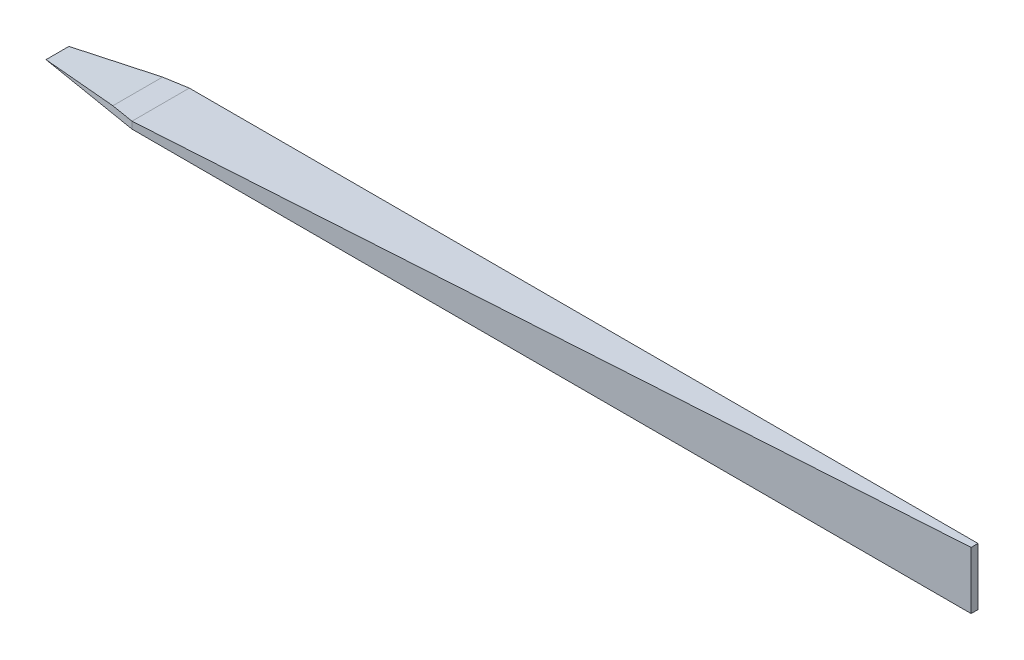
ISO-10303-21;
HEADER;
FILE_DESCRIPTION(('STEP AP214'),'2;1');
FILE_NAME('part.step','',(''),(''),'','','');
FILE_SCHEMA(('AUTOMOTIVE_DESIGN { 1 0 10303 214 1 1 1 1 }'));
ENDSEC;
DATA;
#1=APPLICATION_CONTEXT('core data for automotive mechanical design processes');
#2=APPLICATION_PROTOCOL_DEFINITION('international standard','automotive_design',2000,#1);
#3=PRODUCT_CONTEXT('',#1,'mechanical');
#4=PRODUCT('Part','Part','',(#3));
#5=PRODUCT_RELATED_PRODUCT_CATEGORY('part','',(#4));
#6=PRODUCT_DEFINITION_FORMATION('','',#4);
#7=PRODUCT_DEFINITION_CONTEXT('part definition',#1,'design');
#8=PRODUCT_DEFINITION('design','',#6,#7);
#9=PRODUCT_DEFINITION_SHAPE('','',#8);
#10=(LENGTH_UNIT() NAMED_UNIT(*) SI_UNIT(.MILLI.,.METRE.));
#11=(NAMED_UNIT(*) PLANE_ANGLE_UNIT() SI_UNIT($,.RADIAN.));
#12=(NAMED_UNIT(*) SI_UNIT($,.STERADIAN.) SOLID_ANGLE_UNIT());
#13=UNCERTAINTY_MEASURE_WITH_UNIT(LENGTH_MEASURE(1.E-05),#10,'distance_accuracy_value','');
#14=(GEOMETRIC_REPRESENTATION_CONTEXT(3) GLOBAL_UNCERTAINTY_ASSIGNED_CONTEXT((#13)) GLOBAL_UNIT_ASSIGNED_CONTEXT((#10,
#11,#12)) REPRESENTATION_CONTEXT('',''));
#15=CARTESIAN_POINT('',(0.,0.,0.));
#16=DIRECTION('',(0.,0.,1.));
#17=DIRECTION('',(1.,0.,0.));
#18=AXIS2_PLACEMENT_3D('',#15,#16,#17);
#19=CARTESIAN_POINT('',(0.,0.06,0.));
#20=DIRECTION('',(0.,1.,0.));
#21=DIRECTION('',(0.,0.,1.));
#22=AXIS2_PLACEMENT_3D('',#19,#20,#21);
#23=PLANE('',#22);
#24=DIRECTION('',(0.,0.,1.));
#25=VECTOR('',#24,1.);
#26=CARTESIAN_POINT('',(-7.1,0.06,0.));
#27=LINE('',#26,#25);
#28=CARTESIAN_POINT('',(-7.1,0.06,-0.249999999999999));
#29=VERTEX_POINT('',#28);
#30=CARTESIAN_POINT('',(-7.1,0.0599999999999999,0.249999999999999));
#31=VERTEX_POINT('',#30);
#32=EDGE_CURVE('E55',#29,#31,#27,.T.);
#33=ORIENTED_EDGE('',*,*,#32,.F.);
#34=DIRECTION('',(0.986393923832144,0.,-0.164398987305357));
#35=VECTOR('',#34,1.);
#36=CARTESIAN_POINT('',(-8.,0.06,-0.0999999999999998));
#37=LINE('',#36,#35);
#38=CARTESIAN_POINT('',(-7.30000000000001,0.0599999999999994,-0.216666666666664));
#39=VERTEX_POINT('',#38);
#40=EDGE_CURVE('E145',#39,#29,#37,.T.);
#41=ORIENTED_EDGE('',*,*,#40,.F.);
#42=DIRECTION('',(0.,0.,1.));
#43=VECTOR('',#42,1.);
#44=CARTESIAN_POINT('',(-7.3,0.06,-1.));
#45=LINE('',#44,#43);
#46=CARTESIAN_POINT('',(-7.3,0.06,0.216666666666666));
#47=VERTEX_POINT('',#46);
#48=EDGE_CURVE('E128',#39,#47,#45,.T.);
#49=ORIENTED_EDGE('',*,*,#48,.T.);
#50=DIRECTION('',(0.986393923832144,0.,0.164398987305357));
#51=VECTOR('',#50,1.);
#52=CARTESIAN_POINT('',(-8.,0.06,0.0999999999999998));
#53=LINE('',#52,#51);
#54=EDGE_CURVE('E71',#47,#31,#53,.T.);
#55=ORIENTED_EDGE('',*,*,#54,.T.);
#56=EDGE_LOOP('',(#33,#41,#49,#55));
#57=FACE_BOUND('',#56,.T.);
#58=ADVANCED_FACE('F51',(#57),#23,.T.);
#59=CARTESIAN_POINT('',(0.,0.,0.));
#60=DIRECTION('',(0.,1.,0.));
#61=DIRECTION('',(0.,0.,1.));
#62=AXIS2_PLACEMENT_3D('',#59,#60,#61);
#63=PLANE('',#62);
#64=DIRECTION('',(0.986393923832144,0.,-0.164398987305357));
#65=VECTOR('',#64,1.);
#66=CARTESIAN_POINT('',(-8.,0.,-0.0999999999999998));
#67=LINE('',#66,#65);
#68=CARTESIAN_POINT('',(-8.,0.,-0.0999999999999998));
#69=VERTEX_POINT('',#68);
#70=CARTESIAN_POINT('',(-7.1,0.,-0.249999999999999));
#71=VERTEX_POINT('',#70);
#72=EDGE_CURVE('E133',#69,#71,#67,.T.);
#73=ORIENTED_EDGE('',*,*,#72,.T.);
#74=DIRECTION('',(0.,0.,1.));
#75=VECTOR('',#74,1.);
#76=CARTESIAN_POINT('',(-7.1,0.,0.));
#77=LINE('',#76,#75);
#78=CARTESIAN_POINT('',(-7.1,0.,0.249999999999999));
#79=VERTEX_POINT('',#78);
#80=EDGE_CURVE('E107',#71,#79,#77,.T.);
#81=ORIENTED_EDGE('',*,*,#80,.T.);
#82=DIRECTION('',(0.986393923832144,0.,0.164398987305357));
#83=VECTOR('',#82,1.);
#84=CARTESIAN_POINT('',(-8.,0.,0.0999999999999998));
#85=LINE('',#84,#83);
#86=CARTESIAN_POINT('',(-8.,0.,0.0999999999999998));
#87=VERTEX_POINT('',#86);
#88=EDGE_CURVE('E124',#87,#79,#85,.T.);
#89=ORIENTED_EDGE('',*,*,#88,.F.);
#90=DIRECTION('',(0.,0.,-1.));
#91=VECTOR('',#90,1.);
#92=CARTESIAN_POINT('',(-8.,0.,0.));
#93=LINE('',#92,#91);
#94=EDGE_CURVE('E144',#87,#69,#93,.T.);
#95=ORIENTED_EDGE('',*,*,#94,.T.);
#96=EDGE_LOOP('',(#73,#81,#89,#95));
#97=FACE_BOUND('',#96,.T.);
#98=ADVANCED_FACE('F53',(#97),#63,.F.);
#99=CARTESIAN_POINT('',(-7.3,0.06,-1.));
#100=DIRECTION('',(-0.0854011413464358,0.996346649041751,0.));
#101=DIRECTION('',(-0.996346649041751,-0.0854011413464358,0.));
#102=AXIS2_PLACEMENT_3D('',#99,#100,#101);
#103=PLANE('',#102);
#104=ORIENTED_EDGE('',*,*,#48,.F.);
#105=DIRECTION('',(-0.982887157648091,-0.0842474706555507,0.163814526274681));
#106=VECTOR('',#105,1.);
#107=CARTESIAN_POINT('',(-7.17387456461259,0.0708107516046353,-0.237687572564568));
#108=LINE('',#107,#106);
#109=EDGE_CURVE('E13',#39,#69,#108,.T.);
#110=ORIENTED_EDGE('',*,*,#109,.T.);
#111=ORIENTED_EDGE('',*,*,#94,.F.);
#112=DIRECTION('',(-0.982887157648091,-0.0842474706555507,-0.163814526274681));
#113=VECTOR('',#112,1.);
#114=CARTESIAN_POINT('',(-7.49589695283577,0.043208832614077,0.184017174527372));
#115=LINE('',#114,#113);
#116=EDGE_CURVE('E62',#47,#87,#115,.T.);
#117=ORIENTED_EDGE('',*,*,#116,.F.);
#118=EDGE_LOOP('',(#104,#110,#111,#117));
#119=FACE_BOUND('',#118,.T.);
#120=ADVANCED_FACE('F283',(#119),#103,.T.);
#121=CARTESIAN_POINT('',(-8.,0.06,0.0999999999999998));
#122=DIRECTION('',(0.164398987305357,0.,-0.986393923832144));
#123=DIRECTION('',(-0.986393923832144,0.,-0.164398987305357));
#124=AXIS2_PLACEMENT_3D('',#121,#122,#123);
#125=PLANE('',#124);
#126=ORIENTED_EDGE('',*,*,#116,.T.);
#127=ORIENTED_EDGE('',*,*,#88,.T.);
#128=DIRECTION('',(0.,1.,0.));
#129=VECTOR('',#128,1.);
#130=CARTESIAN_POINT('',(-7.1,0.,0.249999999999999));
#131=LINE('',#130,#129);
#132=EDGE_CURVE('E114',#31,#79,#131,.F.);
#133=ORIENTED_EDGE('',*,*,#132,.F.);
#134=ORIENTED_EDGE('',*,*,#54,.F.);
#135=EDGE_LOOP('',(#126,#127,#133,#134));
#136=FACE_BOUND('',#135,.T.);
#137=ADVANCED_FACE('F122',(#136),#125,.F.);
#138=CARTESIAN_POINT('',(-8.,0.06,-0.0999999999999998));
#139=DIRECTION('',(-0.164398987305357,0.,-0.986393923832144));
#140=DIRECTION('',(-0.986393923832144,0.,0.164398987305357));
#141=AXIS2_PLACEMENT_3D('',#138,#139,#140);
#142=PLANE('',#141);
#143=ORIENTED_EDGE('',*,*,#40,.T.);
#144=DIRECTION('',(0.,1.,0.));
#145=VECTOR('',#144,1.);
#146=CARTESIAN_POINT('',(-7.1,0.06,-0.249999999999999));
#147=LINE('',#146,#145);
#148=EDGE_CURVE('E91',#29,#71,#147,.F.);
#149=ORIENTED_EDGE('',*,*,#148,.T.);
#150=ORIENTED_EDGE('',*,*,#72,.F.);
#151=ORIENTED_EDGE('',*,*,#109,.F.);
#152=EDGE_LOOP('',(#143,#149,#150,#151));
#153=FACE_BOUND('',#152,.T.);
#154=ADVANCED_FACE('F169',(#153),#142,.T.);
#155=CARTESIAN_POINT('',(0.,0.,0.));
#156=DIRECTION('',(-1.,0.,0.));
#157=DIRECTION('',(0.,0.,1.));
#158=AXIS2_PLACEMENT_3D('',#155,#156,#157);
#159=PLANE('',#158);
#160=DIRECTION('',(0.,-1.,0.));
#161=VECTOR('',#160,1.);
#162=CARTESIAN_POINT('',(0.,0.28,-0.03));
#163=LINE('',#162,#161);
#164=CARTESIAN_POINT('',(0.,0.28,-0.03));
#165=VERTEX_POINT('',#164);
#166=CARTESIAN_POINT('',(0.,-0.22,-0.03));
#167=VERTEX_POINT('',#166);
#168=EDGE_CURVE('E221',#165,#167,#163,.T.);
#169=ORIENTED_EDGE('',*,*,#168,.F.);
#170=DIRECTION('',(0.,0.,-1.));
#171=VECTOR('',#170,1.);
#172=CARTESIAN_POINT('',(0.,0.28,-0.03));
#173=LINE('',#172,#171);
#174=CARTESIAN_POINT('',(0.,0.28,0.03));
#175=VERTEX_POINT('',#174);
#176=EDGE_CURVE('E108',#175,#165,#173,.T.);
#177=ORIENTED_EDGE('',*,*,#176,.F.);
#178=DIRECTION('',(0.,1.,0.));
#179=VECTOR('',#178,1.);
#180=CARTESIAN_POINT('',(0.,0.28,0.03));
#181=LINE('',#180,#179);
#182=CARTESIAN_POINT('',(0.,-0.22,0.03));
#183=VERTEX_POINT('',#182);
#184=EDGE_CURVE('E117',#183,#175,#181,.T.);
#185=ORIENTED_EDGE('',*,*,#184,.F.);
#186=DIRECTION('',(0.,0.,1.));
#187=VECTOR('',#186,1.);
#188=CARTESIAN_POINT('',(0.,-0.22,-0.03));
#189=LINE('',#188,#187);
#190=EDGE_CURVE('E214',#167,#183,#189,.T.);
#191=ORIENTED_EDGE('',*,*,#190,.F.);
#192=EDGE_LOOP('',(#169,#177,#185,#191));
#193=FACE_BOUND('',#192,.T.);
#194=ADVANCED_FACE('F181',(#193),#159,.F.);
#195=CARTESIAN_POINT('',(-0.00866773421273763,0.279731422320169,0.));
#196=DIRECTION('',(-0.0309710509895535,0.999520281935591,0.));
#197=DIRECTION('',(-0.999520281935591,-0.0309710509895535,0.));
#198=AXIS2_PLACEMENT_3D('',#195,#196,#197);
#199=PLANE('',#198);
#200=DIRECTION('',(0.999041253597723,0.0309562078579576,-0.0309562078579575));
#201=VECTOR('',#200,1.);
#202=CARTESIAN_POINT('',(-7.1,0.06,0.249999999999999));
#203=LINE('',#202,#201);
#204=EDGE_CURVE('E101',#31,#175,#203,.T.);
#205=ORIENTED_EDGE('',*,*,#204,.T.);
#206=ORIENTED_EDGE('',*,*,#176,.T.);
#207=DIRECTION('',(0.999041253597723,0.0309562078579576,0.0309562078579575));
#208=VECTOR('',#207,1.);
#209=CARTESIAN_POINT('',(-7.1,0.06,-0.249999999999999));
#210=LINE('',#209,#208);
#211=EDGE_CURVE('E102',#29,#165,#210,.T.);
#212=ORIENTED_EDGE('',*,*,#211,.F.);
#213=ORIENTED_EDGE('',*,*,#32,.T.);
#214=EDGE_LOOP('',(#205,#206,#212,#213));
#215=FACE_BOUND('',#214,.T.);
#216=ADVANCED_FACE('F98',(#215),#199,.T.);
#217=CARTESIAN_POINT('',(0.0009286858085076,0.,-0.0299712238200181));
#218=DIRECTION('',(0.0309710509895534,0.,-0.999520281935591));
#219=DIRECTION('',(-0.999520281935591,0.,-0.0309710509895534));
#220=AXIS2_PLACEMENT_3D('',#217,#218,#219);
#221=PLANE('',#220);
#222=ORIENTED_EDGE('',*,*,#211,.T.);
#223=ORIENTED_EDGE('',*,*,#168,.T.);
#224=DIRECTION('',(0.999041253597723,-0.0309562078579576,0.0309562078579575));
#225=VECTOR('',#224,1.);
#226=CARTESIAN_POINT('',(-7.1,0.,-0.249999999999999));
#227=LINE('',#226,#225);
#228=EDGE_CURVE('E166',#71,#167,#227,.T.);
#229=ORIENTED_EDGE('',*,*,#228,.F.);
#230=ORIENTED_EDGE('',*,*,#148,.F.);
#231=EDGE_LOOP('',(#222,#223,#229,#230));
#232=FACE_BOUND('',#231,.T.);
#233=ADVANCED_FACE('F258',(#232),#221,.T.);
#234=CARTESIAN_POINT('',(0.000928685808507599,0.,0.0299712238200181));
#235=DIRECTION('',(0.0309710509895534,0.,0.999520281935591));
#236=DIRECTION('',(0.999520281935591,0.,-0.0309710509895534));
#237=AXIS2_PLACEMENT_3D('',#234,#235,#236);
#238=PLANE('',#237);
#239=DIRECTION('',(0.999041253597723,-0.0309562078579576,-0.0309562078579575));
#240=VECTOR('',#239,1.);
#241=CARTESIAN_POINT('',(-7.1,0.,0.249999999999999));
#242=LINE('',#241,#240);
#243=EDGE_CURVE('E167',#79,#183,#242,.T.);
#244=ORIENTED_EDGE('',*,*,#243,.T.);
#245=ORIENTED_EDGE('',*,*,#184,.T.);
#246=ORIENTED_EDGE('',*,*,#204,.F.);
#247=ORIENTED_EDGE('',*,*,#132,.T.);
#248=EDGE_LOOP('',(#244,#245,#246,#247));
#249=FACE_BOUND('',#248,.T.);
#250=ADVANCED_FACE('F113',(#249),#238,.T.);
#251=CARTESIAN_POINT('',(-0.00681036259572242,-0.219788974680133,0.));
#252=DIRECTION('',(-0.0309710509895535,-0.999520281935591,0.));
#253=DIRECTION('',(0.999520281935591,-0.0309710509895535,0.));
#254=AXIS2_PLACEMENT_3D('',#251,#252,#253);
#255=PLANE('',#254);
#256=ORIENTED_EDGE('',*,*,#228,.T.);
#257=ORIENTED_EDGE('',*,*,#190,.T.);
#258=ORIENTED_EDGE('',*,*,#243,.F.);
#259=ORIENTED_EDGE('',*,*,#80,.F.);
#260=EDGE_LOOP('',(#256,#257,#258,#259));
#261=FACE_BOUND('',#260,.T.);
#262=ADVANCED_FACE('F164',(#261),#255,.T.);
#263=CLOSED_SHELL('',(#58,#98,#120,#137,#154,#194,#216,#233,#250,#262));
#264=MANIFOLD_SOLID_BREP('B2',#263);
#265=ADVANCED_BREP_SHAPE_REPRESENTATION('',(#18,#264),#14);
#266=SHAPE_DEFINITION_REPRESENTATION(#9,#265);
ENDSEC;
END-ISO-10303-21;
